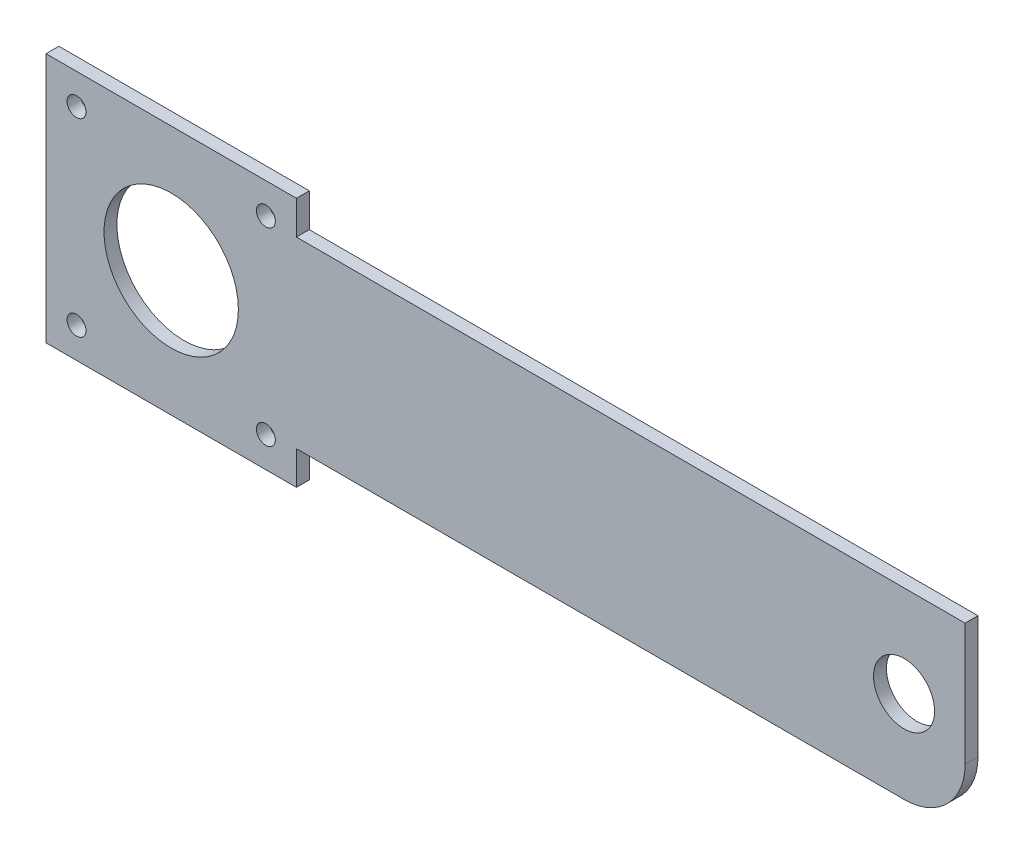
ISO-10303-21;
HEADER;
FILE_DESCRIPTION(('STEP AP214'),'2;1');
FILE_NAME('part.step','',(''),(''),'','','');
FILE_SCHEMA(('AUTOMOTIVE_DESIGN { 1 0 10303 214 1 1 1 1 }'));
ENDSEC;
DATA;
#1=APPLICATION_CONTEXT('core data for automotive mechanical design processes');
#2=APPLICATION_PROTOCOL_DEFINITION('international standard','automotive_design',2000,#1);
#3=PRODUCT_CONTEXT('',#1,'mechanical');
#4=PRODUCT('Part','Part','',(#3));
#5=PRODUCT_RELATED_PRODUCT_CATEGORY('part','',(#4));
#6=PRODUCT_DEFINITION_FORMATION('','',#4);
#7=PRODUCT_DEFINITION_CONTEXT('part definition',#1,'design');
#8=PRODUCT_DEFINITION('design','',#6,#7);
#9=PRODUCT_DEFINITION_SHAPE('','',#8);
#10=(LENGTH_UNIT() NAMED_UNIT(*) SI_UNIT(.MILLI.,.METRE.));
#11=(NAMED_UNIT(*) PLANE_ANGLE_UNIT() SI_UNIT($,.RADIAN.));
#12=(NAMED_UNIT(*) SI_UNIT($,.STERADIAN.) SOLID_ANGLE_UNIT());
#13=UNCERTAINTY_MEASURE_WITH_UNIT(LENGTH_MEASURE(1.E-05),#10,'distance_accuracy_value','');
#14=(GEOMETRIC_REPRESENTATION_CONTEXT(3) GLOBAL_UNCERTAINTY_ASSIGNED_CONTEXT((#13)) GLOBAL_UNIT_ASSIGNED_CONTEXT((#10,
#11,#12)) REPRESENTATION_CONTEXT('',''));
#15=CARTESIAN_POINT('',(0.,0.,0.));
#16=DIRECTION('',(0.,0.,1.));
#17=DIRECTION('',(1.,0.,0.));
#18=AXIS2_PLACEMENT_3D('',#15,#16,#17);
#19=CARTESIAN_POINT('',(0.,0.,2.11));
#20=DIRECTION('',(0.,0.,1.));
#21=DIRECTION('',(1.,0.,0.));
#22=AXIS2_PLACEMENT_3D('',#19,#20,#21);
#23=PLANE('',#22);
#24=CARTESIAN_POINT('',(148.208826457115,-6.40576797650548,2.11));
#25=DIRECTION('',(0.,0.,1.));
#26=DIRECTION('',(1.,0.,0.));
#27=AXIS2_PLACEMENT_3D('',#24,#25,#26);
#28=CIRCLE('',#27,4.99999999999999);
#29=CARTESIAN_POINT('',(153.208826457115,-6.40576797650548,2.11));
#30=VERTEX_POINT('',#29);
#31=EDGE_CURVE('E207',#30,#30,#28,.T.);
#32=ORIENTED_EDGE('',*,*,#31,.F.);
#33=EDGE_LOOP('',(#32));
#34=FACE_BOUND('',#33,.T.);
#35=CARTESIAN_POINT('',(28.208826457115,-6.40576797650548,2.11));
#36=DIRECTION('',(0.,0.,1.));
#37=DIRECTION('',(1.,0.,0.));
#38=AXIS2_PLACEMENT_3D('',#35,#36,#37);
#39=CIRCLE('',#38,11.);
#40=CARTESIAN_POINT('',(39.208826457115,-6.40576797650548,2.11));
#41=VERTEX_POINT('',#40);
#42=EDGE_CURVE('E201',#41,#41,#39,.T.);
#43=ORIENTED_EDGE('',*,*,#42,.F.);
#44=EDGE_LOOP('',(#43));
#45=FACE_BOUND('',#44,.T.);
#46=CARTESIAN_POINT('',(43.7088264571151,9.09423202349441,2.11));
#47=DIRECTION('',(0.,0.,1.));
#48=DIRECTION('',(1.,0.,0.));
#49=AXIS2_PLACEMENT_3D('',#46,#47,#48);
#50=CIRCLE('',#49,1.55);
#51=CARTESIAN_POINT('',(45.2588264571151,9.09423202349441,2.11));
#52=VERTEX_POINT('',#51);
#53=EDGE_CURVE('E184',#52,#52,#50,.T.);
#54=ORIENTED_EDGE('',*,*,#53,.F.);
#55=EDGE_LOOP('',(#54));
#56=FACE_BOUND('',#55,.T.);
#57=CARTESIAN_POINT('',(12.708826457115,-21.9057679765055,2.11));
#58=DIRECTION('',(0.,0.,1.));
#59=DIRECTION('',(1.,0.,0.));
#60=AXIS2_PLACEMENT_3D('',#57,#58,#59);
#61=CIRCLE('',#60,1.55);
#62=CARTESIAN_POINT('',(14.258826457115,-21.9057679765055,2.11));
#63=VERTEX_POINT('',#62);
#64=EDGE_CURVE('E164',#63,#63,#61,.T.);
#65=ORIENTED_EDGE('',*,*,#64,.F.);
#66=EDGE_LOOP('',(#65));
#67=FACE_BOUND('',#66,.T.);
#68=DIRECTION('',(1.,0.,0.));
#69=VECTOR('',#68,1.);
#70=CARTESIAN_POINT('',(48.708826457115,-21.4057679765055,2.11));
#71=LINE('',#70,#69);
#72=CARTESIAN_POINT('',(48.708826457115,-21.4057679765055,2.11));
#73=VERTEX_POINT('',#72);
#74=CARTESIAN_POINT('',(148.208826457115,-21.4057679765055,2.11));
#75=VERTEX_POINT('',#74);
#76=EDGE_CURVE('E166',#73,#75,#71,.T.);
#77=ORIENTED_EDGE('',*,*,#76,.T.);
#78=CARTESIAN_POINT('',(148.208826457115,-11.4057679765055,2.11));
#79=DIRECTION('',(0.,0.,1.));
#80=DIRECTION('',(1.,0.,0.));
#81=AXIS2_PLACEMENT_3D('',#78,#79,#80);
#82=CIRCLE('',#81,10.);
#83=CARTESIAN_POINT('',(158.208826457115,-11.4057679765055,2.11));
#84=VERTEX_POINT('',#83);
#85=EDGE_CURVE('E11',#75,#84,#82,.T.);
#86=ORIENTED_EDGE('',*,*,#85,.T.);
#87=DIRECTION('',(0.,1.,0.));
#88=VECTOR('',#87,1.);
#89=CARTESIAN_POINT('',(158.208826457115,-21.4057679765055,2.11));
#90=LINE('',#89,#88);
#91=CARTESIAN_POINT('',(158.208826457115,8.59423202349452,2.11));
#92=VERTEX_POINT('',#91);
#93=EDGE_CURVE('E120',#84,#92,#90,.T.);
#94=ORIENTED_EDGE('',*,*,#93,.T.);
#95=DIRECTION('',(-1.,0.,0.));
#96=VECTOR('',#95,1.);
#97=CARTESIAN_POINT('',(48.708826457115,8.59423202349451,2.11));
#98=LINE('',#97,#96);
#99=CARTESIAN_POINT('',(48.708826457115,8.59423202349451,2.11));
#100=VERTEX_POINT('',#99);
#101=EDGE_CURVE('E115',#92,#100,#98,.T.);
#102=ORIENTED_EDGE('',*,*,#101,.T.);
#103=DIRECTION('',(0.,1.,0.));
#104=VECTOR('',#103,1.);
#105=CARTESIAN_POINT('',(48.708826457115,8.59423202349451,2.11));
#106=LINE('',#105,#104);
#107=CARTESIAN_POINT('',(48.708826457115,14.0942320234945,2.11));
#108=VERTEX_POINT('',#107);
#109=EDGE_CURVE('E104',#100,#108,#106,.T.);
#110=ORIENTED_EDGE('',*,*,#109,.T.);
#111=DIRECTION('',(-1.,0.,0.));
#112=VECTOR('',#111,1.);
#113=CARTESIAN_POINT('',(7.70882645711496,14.0942320234945,2.11));
#114=LINE('',#113,#112);
#115=CARTESIAN_POINT('',(7.70882645711496,14.0942320234945,2.11));
#116=VERTEX_POINT('',#115);
#117=EDGE_CURVE('E114',#108,#116,#114,.T.);
#118=ORIENTED_EDGE('',*,*,#117,.T.);
#119=DIRECTION('',(0.,-1.,0.));
#120=VECTOR('',#119,1.);
#121=CARTESIAN_POINT('',(7.70882645711496,-26.9057679765055,2.11));
#122=LINE('',#121,#120);
#123=CARTESIAN_POINT('',(7.70882645711496,-26.9057679765055,2.11));
#124=VERTEX_POINT('',#123);
#125=EDGE_CURVE('E172',#116,#124,#122,.T.);
#126=ORIENTED_EDGE('',*,*,#125,.T.);
#127=DIRECTION('',(1.,0.,0.));
#128=VECTOR('',#127,1.);
#129=CARTESIAN_POINT('',(7.70882645711496,-26.9057679765055,2.11));
#130=LINE('',#129,#128);
#131=CARTESIAN_POINT('',(48.708826457115,-26.9057679765055,2.11));
#132=VERTEX_POINT('',#131);
#133=EDGE_CURVE('E170',#124,#132,#130,.T.);
#134=ORIENTED_EDGE('',*,*,#133,.T.);
#135=DIRECTION('',(0.,1.,0.));
#136=VECTOR('',#135,1.);
#137=CARTESIAN_POINT('',(48.708826457115,-26.9057679765055,2.11));
#138=LINE('',#137,#136);
#139=EDGE_CURVE('E168',#132,#73,#138,.T.);
#140=ORIENTED_EDGE('',*,*,#139,.T.);
#141=EDGE_LOOP('',(#77,#86,#94,#102,#110,#118,#126,#134,#140));
#142=FACE_BOUND('',#141,.T.);
#143=CARTESIAN_POINT('',(12.708826457115,9.09423202349458,2.11));
#144=DIRECTION('',(0.,0.,1.));
#145=DIRECTION('',(1.,0.,0.));
#146=AXIS2_PLACEMENT_3D('',#143,#144,#145);
#147=CIRCLE('',#146,1.55);
#148=CARTESIAN_POINT('',(14.258826457115,9.09423202349458,2.11));
#149=VERTEX_POINT('',#148);
#150=EDGE_CURVE('E178',#149,#149,#147,.T.);
#151=ORIENTED_EDGE('',*,*,#150,.F.);
#152=EDGE_LOOP('',(#151));
#153=FACE_BOUND('',#152,.T.);
#154=CARTESIAN_POINT('',(43.7088264571148,-21.9057679765057,2.11));
#155=DIRECTION('',(0.,0.,1.));
#156=DIRECTION('',(1.,0.,0.));
#157=AXIS2_PLACEMENT_3D('',#154,#155,#156);
#158=CIRCLE('',#157,1.55);
#159=CARTESIAN_POINT('',(45.2588264571148,-21.9057679765057,2.11));
#160=VERTEX_POINT('',#159);
#161=EDGE_CURVE('E190',#160,#160,#158,.T.);
#162=ORIENTED_EDGE('',*,*,#161,.F.);
#163=EDGE_LOOP('',(#162));
#164=FACE_BOUND('',#163,.T.);
#165=ADVANCED_FACE('F33',(#34,#45,#56,#67,#142,#153,#164),#23,.T.);
#166=CARTESIAN_POINT('',(0.,0.,0.));
#167=DIRECTION('',(0.,0.,1.));
#168=DIRECTION('',(1.,0.,0.));
#169=AXIS2_PLACEMENT_3D('',#166,#167,#168);
#170=PLANE('',#169);
#171=CARTESIAN_POINT('',(148.208826457115,-6.40576797650548,0.));
#172=DIRECTION('',(0.,0.,1.));
#173=DIRECTION('',(1.,0.,0.));
#174=AXIS2_PLACEMENT_3D('',#171,#172,#173);
#175=CIRCLE('',#174,4.99999999999999);
#176=CARTESIAN_POINT('',(153.208826457115,-6.40576797650548,0.));
#177=VERTEX_POINT('',#176);
#178=EDGE_CURVE('E204',#177,#177,#175,.F.);
#179=ORIENTED_EDGE('',*,*,#178,.F.);
#180=EDGE_LOOP('',(#179));
#181=FACE_BOUND('',#180,.T.);
#182=CARTESIAN_POINT('',(28.208826457115,-6.40576797650548,0.));
#183=DIRECTION('',(0.,0.,1.));
#184=DIRECTION('',(1.,0.,0.));
#185=AXIS2_PLACEMENT_3D('',#182,#183,#184);
#186=CIRCLE('',#185,11.);
#187=CARTESIAN_POINT('',(39.208826457115,-6.40576797650548,0.));
#188=VERTEX_POINT('',#187);
#189=EDGE_CURVE('E196',#188,#188,#186,.F.);
#190=ORIENTED_EDGE('',*,*,#189,.F.);
#191=EDGE_LOOP('',(#190));
#192=FACE_BOUND('',#191,.T.);
#193=DIRECTION('',(0.,1.,0.));
#194=VECTOR('',#193,1.);
#195=CARTESIAN_POINT('',(158.208826457115,-21.4057679765055,0.));
#196=LINE('',#195,#194);
#197=CARTESIAN_POINT('',(158.208826457115,-11.4057679765055,0.));
#198=VERTEX_POINT('',#197);
#199=CARTESIAN_POINT('',(158.208826457115,8.59423202349452,0.));
#200=VERTEX_POINT('',#199);
#201=EDGE_CURVE('E124',#198,#200,#196,.T.);
#202=ORIENTED_EDGE('',*,*,#201,.F.);
#203=CARTESIAN_POINT('',(148.208826457115,-11.4057679765055,0.));
#204=DIRECTION('',(0.,0.,1.));
#205=DIRECTION('',(1.,0.,0.));
#206=AXIS2_PLACEMENT_3D('',#203,#204,#205);
#207=CIRCLE('',#206,10.);
#208=CARTESIAN_POINT('',(148.208826457115,-21.4057679765055,0.));
#209=VERTEX_POINT('',#208);
#210=EDGE_CURVE('E55',#198,#209,#207,.F.);
#211=ORIENTED_EDGE('',*,*,#210,.T.);
#212=DIRECTION('',(1.,0.,0.));
#213=VECTOR('',#212,1.);
#214=CARTESIAN_POINT('',(48.708826457115,-21.4057679765055,0.));
#215=LINE('',#214,#213);
#216=CARTESIAN_POINT('',(48.708826457115,-21.4057679765055,0.));
#217=VERTEX_POINT('',#216);
#218=EDGE_CURVE('E151',#217,#209,#215,.T.);
#219=ORIENTED_EDGE('',*,*,#218,.F.);
#220=DIRECTION('',(0.,1.,0.));
#221=VECTOR('',#220,1.);
#222=CARTESIAN_POINT('',(48.708826457115,-26.9057679765055,0.));
#223=LINE('',#222,#221);
#224=CARTESIAN_POINT('',(48.708826457115,-26.9057679765055,0.));
#225=VERTEX_POINT('',#224);
#226=EDGE_CURVE('E153',#225,#217,#223,.T.);
#227=ORIENTED_EDGE('',*,*,#226,.F.);
#228=DIRECTION('',(1.,0.,0.));
#229=VECTOR('',#228,1.);
#230=CARTESIAN_POINT('',(7.70882645711496,-26.9057679765055,0.));
#231=LINE('',#230,#229);
#232=CARTESIAN_POINT('',(7.70882645711496,-26.9057679765055,0.));
#233=VERTEX_POINT('',#232);
#234=EDGE_CURVE('E155',#233,#225,#231,.T.);
#235=ORIENTED_EDGE('',*,*,#234,.F.);
#236=DIRECTION('',(0.,-1.,0.));
#237=VECTOR('',#236,1.);
#238=CARTESIAN_POINT('',(7.70882645711496,-26.9057679765055,0.));
#239=LINE('',#238,#237);
#240=CARTESIAN_POINT('',(7.70882645711496,14.0942320234945,0.));
#241=VERTEX_POINT('',#240);
#242=EDGE_CURVE('E157',#241,#233,#239,.T.);
#243=ORIENTED_EDGE('',*,*,#242,.F.);
#244=DIRECTION('',(-1.,0.,0.));
#245=VECTOR('',#244,1.);
#246=CARTESIAN_POINT('',(7.70882645711496,14.0942320234945,0.));
#247=LINE('',#246,#245);
#248=CARTESIAN_POINT('',(48.708826457115,14.0942320234945,0.));
#249=VERTEX_POINT('',#248);
#250=EDGE_CURVE('E159',#249,#241,#247,.T.);
#251=ORIENTED_EDGE('',*,*,#250,.F.);
#252=DIRECTION('',(0.,1.,0.));
#253=VECTOR('',#252,1.);
#254=CARTESIAN_POINT('',(48.708826457115,8.59423202349451,0.));
#255=LINE('',#254,#253);
#256=CARTESIAN_POINT('',(48.708826457115,8.59423202349451,0.));
#257=VERTEX_POINT('',#256);
#258=EDGE_CURVE('E161',#257,#249,#255,.T.);
#259=ORIENTED_EDGE('',*,*,#258,.F.);
#260=DIRECTION('',(-1.,0.,0.));
#261=VECTOR('',#260,1.);
#262=CARTESIAN_POINT('',(48.708826457115,8.59423202349451,0.));
#263=LINE('',#262,#261);
#264=EDGE_CURVE('E128',#200,#257,#263,.T.);
#265=ORIENTED_EDGE('',*,*,#264,.F.);
#266=EDGE_LOOP('',(#202,#211,#219,#227,#235,#243,#251,#259,#265));
#267=FACE_BOUND('',#266,.T.);
#268=CARTESIAN_POINT('',(12.708826457115,-21.9057679765055,0.));
#269=DIRECTION('',(0.,0.,1.));
#270=DIRECTION('',(1.,0.,0.));
#271=AXIS2_PLACEMENT_3D('',#268,#269,#270);
#272=CIRCLE('',#271,1.55);
#273=CARTESIAN_POINT('',(14.258826457115,-21.9057679765055,0.));
#274=VERTEX_POINT('',#273);
#275=EDGE_CURVE('E175',#274,#274,#272,.T.);
#276=ORIENTED_EDGE('',*,*,#275,.T.);
#277=EDGE_LOOP('',(#276));
#278=FACE_BOUND('',#277,.T.);
#279=CARTESIAN_POINT('',(12.708826457115,9.09423202349458,0.));
#280=DIRECTION('',(0.,0.,1.));
#281=DIRECTION('',(1.,0.,0.));
#282=AXIS2_PLACEMENT_3D('',#279,#280,#281);
#283=CIRCLE('',#282,1.55);
#284=CARTESIAN_POINT('',(14.258826457115,9.09423202349458,0.));
#285=VERTEX_POINT('',#284);
#286=EDGE_CURVE('E181',#285,#285,#283,.T.);
#287=ORIENTED_EDGE('',*,*,#286,.T.);
#288=EDGE_LOOP('',(#287));
#289=FACE_BOUND('',#288,.T.);
#290=CARTESIAN_POINT('',(43.7088264571151,9.09423202349441,0.));
#291=DIRECTION('',(0.,0.,1.));
#292=DIRECTION('',(1.,0.,0.));
#293=AXIS2_PLACEMENT_3D('',#290,#291,#292);
#294=CIRCLE('',#293,1.55);
#295=CARTESIAN_POINT('',(45.2588264571151,9.09423202349441,0.));
#296=VERTEX_POINT('',#295);
#297=EDGE_CURVE('E187',#296,#296,#294,.T.);
#298=ORIENTED_EDGE('',*,*,#297,.T.);
#299=EDGE_LOOP('',(#298));
#300=FACE_BOUND('',#299,.T.);
#301=CARTESIAN_POINT('',(43.7088264571148,-21.9057679765057,0.));
#302=DIRECTION('',(0.,0.,1.));
#303=DIRECTION('',(1.,0.,0.));
#304=AXIS2_PLACEMENT_3D('',#301,#302,#303);
#305=CIRCLE('',#304,1.55);
#306=CARTESIAN_POINT('',(45.2588264571148,-21.9057679765057,0.));
#307=VERTEX_POINT('',#306);
#308=EDGE_CURVE('E193',#307,#307,#305,.T.);
#309=ORIENTED_EDGE('',*,*,#308,.T.);
#310=EDGE_LOOP('',(#309));
#311=FACE_BOUND('',#310,.T.);
#312=ADVANCED_FACE('F215',(#181,#192,#267,#278,#289,#300,#311),#170,.F.);
#313=CARTESIAN_POINT('',(48.708826457115,8.59423202349451,2.11));
#314=DIRECTION('',(0.,-1.,0.));
#315=DIRECTION('',(1.,0.,0.));
#316=AXIS2_PLACEMENT_3D('',#313,#314,#315);
#317=PLANE('',#316);
#318=ORIENTED_EDGE('',*,*,#264,.T.);
#319=DIRECTION('',(0.,0.,-1.));
#320=VECTOR('',#319,1.);
#321=CARTESIAN_POINT('',(48.708826457115,8.59423202349451,2.11));
#322=LINE('',#321,#320);
#323=EDGE_CURVE('E108',#100,#257,#322,.T.);
#324=ORIENTED_EDGE('',*,*,#323,.F.);
#325=ORIENTED_EDGE('',*,*,#101,.F.);
#326=DIRECTION('',(0.,0.,-1.));
#327=VECTOR('',#326,1.);
#328=CARTESIAN_POINT('',(158.208826457115,8.59423202349452,2.11));
#329=LINE('',#328,#327);
#330=EDGE_CURVE('E148',#92,#200,#329,.T.);
#331=ORIENTED_EDGE('',*,*,#330,.T.);
#332=EDGE_LOOP('',(#318,#324,#325,#331));
#333=FACE_BOUND('',#332,.T.);
#334=ADVANCED_FACE('F126',(#333),#317,.F.);
#335=CARTESIAN_POINT('',(48.708826457115,8.59423202349451,2.11));
#336=DIRECTION('',(-1.,0.,0.));
#337=DIRECTION('',(0.,-1.,0.));
#338=AXIS2_PLACEMENT_3D('',#335,#336,#337);
#339=PLANE('',#338);
#340=ORIENTED_EDGE('',*,*,#258,.T.);
#341=DIRECTION('',(0.,0.,-1.));
#342=VECTOR('',#341,1.);
#343=CARTESIAN_POINT('',(48.708826457115,14.0942320234945,2.11));
#344=LINE('',#343,#342);
#345=EDGE_CURVE('E111',#108,#249,#344,.T.);
#346=ORIENTED_EDGE('',*,*,#345,.F.);
#347=ORIENTED_EDGE('',*,*,#109,.F.);
#348=ORIENTED_EDGE('',*,*,#323,.T.);
#349=EDGE_LOOP('',(#340,#346,#347,#348));
#350=FACE_BOUND('',#349,.T.);
#351=ADVANCED_FACE('F106',(#350),#339,.F.);
#352=CARTESIAN_POINT('',(7.70882645711496,14.0942320234945,2.11));
#353=DIRECTION('',(0.,-1.,0.));
#354=DIRECTION('',(1.,0.,0.));
#355=AXIS2_PLACEMENT_3D('',#352,#353,#354);
#356=PLANE('',#355);
#357=ORIENTED_EDGE('',*,*,#250,.T.);
#358=DIRECTION('',(0.,0.,-1.));
#359=VECTOR('',#358,1.);
#360=CARTESIAN_POINT('',(7.70882645711496,14.0942320234945,2.11));
#361=LINE('',#360,#359);
#362=EDGE_CURVE('E133',#116,#241,#361,.T.);
#363=ORIENTED_EDGE('',*,*,#362,.F.);
#364=ORIENTED_EDGE('',*,*,#117,.F.);
#365=ORIENTED_EDGE('',*,*,#345,.T.);
#366=EDGE_LOOP('',(#357,#363,#364,#365));
#367=FACE_BOUND('',#366,.T.);
#368=ADVANCED_FACE('F277',(#367),#356,.F.);
#369=CARTESIAN_POINT('',(7.70882645711496,-26.9057679765055,2.11));
#370=DIRECTION('',(1.,0.,0.));
#371=DIRECTION('',(0.,0.,-1.));
#372=AXIS2_PLACEMENT_3D('',#369,#370,#371);
#373=PLANE('',#372);
#374=ORIENTED_EDGE('',*,*,#242,.T.);
#375=DIRECTION('',(0.,0.,-1.));
#376=VECTOR('',#375,1.);
#377=CARTESIAN_POINT('',(7.70882645711496,-26.9057679765055,2.11));
#378=LINE('',#377,#376);
#379=EDGE_CURVE('E139',#124,#233,#378,.T.);
#380=ORIENTED_EDGE('',*,*,#379,.F.);
#381=ORIENTED_EDGE('',*,*,#125,.F.);
#382=ORIENTED_EDGE('',*,*,#362,.T.);
#383=EDGE_LOOP('',(#374,#380,#381,#382));
#384=FACE_BOUND('',#383,.T.);
#385=ADVANCED_FACE('F273',(#384),#373,.F.);
#386=CARTESIAN_POINT('',(7.70882645711496,-26.9057679765055,2.11));
#387=DIRECTION('',(0.,1.,0.));
#388=DIRECTION('',(0.,0.,1.));
#389=AXIS2_PLACEMENT_3D('',#386,#387,#388);
#390=PLANE('',#389);
#391=ORIENTED_EDGE('',*,*,#234,.T.);
#392=DIRECTION('',(0.,0.,-1.));
#393=VECTOR('',#392,1.);
#394=CARTESIAN_POINT('',(48.708826457115,-26.9057679765055,2.11));
#395=LINE('',#394,#393);
#396=EDGE_CURVE('E142',#132,#225,#395,.T.);
#397=ORIENTED_EDGE('',*,*,#396,.F.);
#398=ORIENTED_EDGE('',*,*,#133,.F.);
#399=ORIENTED_EDGE('',*,*,#379,.T.);
#400=EDGE_LOOP('',(#391,#397,#398,#399));
#401=FACE_BOUND('',#400,.T.);
#402=ADVANCED_FACE('F269',(#401),#390,.F.);
#403=CARTESIAN_POINT('',(48.708826457115,-26.9057679765055,2.11));
#404=DIRECTION('',(-1.,0.,0.));
#405=DIRECTION('',(0.,-1.,0.));
#406=AXIS2_PLACEMENT_3D('',#403,#404,#405);
#407=PLANE('',#406);
#408=ORIENTED_EDGE('',*,*,#226,.T.);
#409=DIRECTION('',(0.,0.,-1.));
#410=VECTOR('',#409,1.);
#411=CARTESIAN_POINT('',(48.708826457115,-21.4057679765055,2.11));
#412=LINE('',#411,#410);
#413=EDGE_CURVE('E145',#73,#217,#412,.T.);
#414=ORIENTED_EDGE('',*,*,#413,.F.);
#415=ORIENTED_EDGE('',*,*,#139,.F.);
#416=ORIENTED_EDGE('',*,*,#396,.T.);
#417=EDGE_LOOP('',(#408,#414,#415,#416));
#418=FACE_BOUND('',#417,.T.);
#419=ADVANCED_FACE('F266',(#418),#407,.F.);
#420=CARTESIAN_POINT('',(48.708826457115,-21.4057679765055,2.11));
#421=DIRECTION('',(0.,1.,0.));
#422=DIRECTION('',(0.,0.,1.));
#423=AXIS2_PLACEMENT_3D('',#420,#421,#422);
#424=PLANE('',#423);
#425=ORIENTED_EDGE('',*,*,#218,.T.);
#426=DIRECTION('',(0.,0.,-1.));
#427=VECTOR('',#426,1.);
#428=CARTESIAN_POINT('',(148.208826457115,-21.4057679765055,2.11));
#429=LINE('',#428,#427);
#430=EDGE_CURVE('E41',#209,#75,#429,.F.);
#431=ORIENTED_EDGE('',*,*,#430,.T.);
#432=ORIENTED_EDGE('',*,*,#76,.F.);
#433=ORIENTED_EDGE('',*,*,#413,.T.);
#434=EDGE_LOOP('',(#425,#431,#432,#433));
#435=FACE_BOUND('',#434,.T.);
#436=ADVANCED_FACE('F262',(#435),#424,.F.);
#437=CARTESIAN_POINT('',(158.208826457115,-21.4057679765055,2.11));
#438=DIRECTION('',(-1.,0.,0.));
#439=DIRECTION('',(0.,0.,1.));
#440=AXIS2_PLACEMENT_3D('',#437,#438,#439);
#441=PLANE('',#440);
#442=ORIENTED_EDGE('',*,*,#93,.F.);
#443=DIRECTION('',(0.,0.,-1.));
#444=VECTOR('',#443,1.);
#445=CARTESIAN_POINT('',(158.208826457115,-11.4057679765055,2.11));
#446=LINE('',#445,#444);
#447=EDGE_CURVE('E129',#84,#198,#446,.T.);
#448=ORIENTED_EDGE('',*,*,#447,.T.);
#449=ORIENTED_EDGE('',*,*,#201,.T.);
#450=ORIENTED_EDGE('',*,*,#330,.F.);
#451=EDGE_LOOP('',(#442,#448,#449,#450));
#452=FACE_BOUND('',#451,.T.);
#453=ADVANCED_FACE('F227',(#452),#441,.F.);
#454=CARTESIAN_POINT('',(12.708826457115,-21.9057679765055,2.11));
#455=DIRECTION('',(0.,0.,-1.));
#456=DIRECTION('',(-1.,0.,0.));
#457=AXIS2_PLACEMENT_3D('',#454,#455,#456);
#458=CYLINDRICAL_SURFACE('',#457,1.55);
#459=ORIENTED_EDGE('',*,*,#64,.T.);
#460=EDGE_LOOP('',(#459));
#461=FACE_BOUND('',#460,.T.);
#462=ORIENTED_EDGE('',*,*,#275,.F.);
#463=EDGE_LOOP('',(#462));
#464=FACE_BOUND('',#463,.T.);
#465=ADVANCED_FACE('F223',(#461,#464),#458,.F.);
#466=CARTESIAN_POINT('',(12.708826457115,9.09423202349458,2.11));
#467=DIRECTION('',(0.,0.,-1.));
#468=DIRECTION('',(-1.,0.,0.));
#469=AXIS2_PLACEMENT_3D('',#466,#467,#468);
#470=CYLINDRICAL_SURFACE('',#469,1.55);
#471=ORIENTED_EDGE('',*,*,#150,.T.);
#472=EDGE_LOOP('',(#471));
#473=FACE_BOUND('',#472,.T.);
#474=ORIENTED_EDGE('',*,*,#286,.F.);
#475=EDGE_LOOP('',(#474));
#476=FACE_BOUND('',#475,.T.);
#477=ADVANCED_FACE('F226',(#473,#476),#470,.F.);
#478=CARTESIAN_POINT('',(43.7088264571151,9.09423202349441,2.11));
#479=DIRECTION('',(0.,0.,-1.));
#480=DIRECTION('',(-1.,0.,0.));
#481=AXIS2_PLACEMENT_3D('',#478,#479,#480);
#482=CYLINDRICAL_SURFACE('',#481,1.55);
#483=ORIENTED_EDGE('',*,*,#53,.T.);
#484=EDGE_LOOP('',(#483));
#485=FACE_BOUND('',#484,.T.);
#486=ORIENTED_EDGE('',*,*,#297,.F.);
#487=EDGE_LOOP('',(#486));
#488=FACE_BOUND('',#487,.T.);
#489=ADVANCED_FACE('F244',(#485,#488),#482,.F.);
#490=CARTESIAN_POINT('',(43.7088264571148,-21.9057679765057,2.11));
#491=DIRECTION('',(0.,0.,-1.));
#492=DIRECTION('',(-1.,0.,0.));
#493=AXIS2_PLACEMENT_3D('',#490,#491,#492);
#494=CYLINDRICAL_SURFACE('',#493,1.55);
#495=ORIENTED_EDGE('',*,*,#161,.T.);
#496=EDGE_LOOP('',(#495));
#497=FACE_BOUND('',#496,.T.);
#498=ORIENTED_EDGE('',*,*,#308,.F.);
#499=EDGE_LOOP('',(#498));
#500=FACE_BOUND('',#499,.T.);
#501=ADVANCED_FACE('F241',(#497,#500),#494,.F.);
#502=CARTESIAN_POINT('',(28.208826457115,-6.40576797650548,-31.1126983722081));
#503=DIRECTION('',(0.,0.,1.));
#504=DIRECTION('',(1.,0.,0.));
#505=AXIS2_PLACEMENT_3D('',#502,#503,#504);
#506=CYLINDRICAL_SURFACE('',#505,11.);
#507=ORIENTED_EDGE('',*,*,#189,.T.);
#508=EDGE_LOOP('',(#507));
#509=FACE_BOUND('',#508,.T.);
#510=ORIENTED_EDGE('',*,*,#42,.T.);
#511=EDGE_LOOP('',(#510));
#512=FACE_BOUND('',#511,.T.);
#513=ADVANCED_FACE('F243',(#509,#512),#506,.F.);
#514=CARTESIAN_POINT('',(148.208826457115,-6.40576797650548,-14.1421356237309));
#515=DIRECTION('',(0.,0.,1.));
#516=DIRECTION('',(1.,0.,0.));
#517=AXIS2_PLACEMENT_3D('',#514,#515,#516);
#518=CYLINDRICAL_SURFACE('',#517,4.99999999999999);
#519=ORIENTED_EDGE('',*,*,#178,.T.);
#520=EDGE_LOOP('',(#519));
#521=FACE_BOUND('',#520,.T.);
#522=ORIENTED_EDGE('',*,*,#31,.T.);
#523=EDGE_LOOP('',(#522));
#524=FACE_BOUND('',#523,.T.);
#525=ADVANCED_FACE('F211',(#521,#524),#518,.F.);
#526=CARTESIAN_POINT('',(148.208826457115,-11.4057679765055,2.11));
#527=DIRECTION('',(0.,0.,-1.));
#528=DIRECTION('',(-1.,0.,0.));
#529=AXIS2_PLACEMENT_3D('',#526,#527,#528);
#530=CYLINDRICAL_SURFACE('',#529,10.);
#531=ORIENTED_EDGE('',*,*,#85,.F.);
#532=ORIENTED_EDGE('',*,*,#430,.F.);
#533=ORIENTED_EDGE('',*,*,#210,.F.);
#534=ORIENTED_EDGE('',*,*,#447,.F.);
#535=EDGE_LOOP('',(#531,#532,#533,#534));
#536=FACE_BOUND('',#535,.T.);
#537=ADVANCED_FACE('F35',(#536),#530,.T.);
#538=CLOSED_SHELL('',(#165,#312,#334,#351,#368,#385,#402,#419,#436,#453,#465,#477,#489,#501,
#513,#525,#537));
#539=MANIFOLD_SOLID_BREP('B2',#538);
#540=ADVANCED_BREP_SHAPE_REPRESENTATION('',(#18,#539),#14);
#541=SHAPE_DEFINITION_REPRESENTATION(#9,#540);
ENDSEC;
END-ISO-10303-21;
